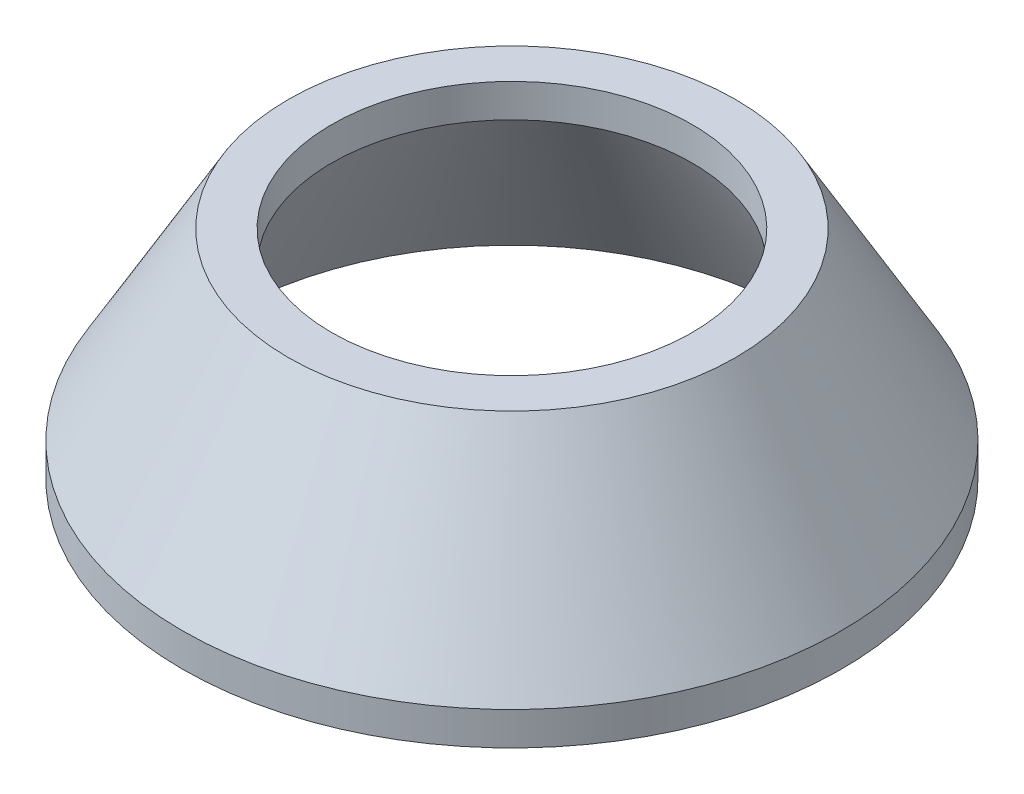
ISO-10303-21;
HEADER;
FILE_DESCRIPTION(('STEP AP214'),'2;1');
FILE_NAME('part.step','',(''),(''),'','','');
FILE_SCHEMA(('AUTOMOTIVE_DESIGN { 1 0 10303 214 1 1 1 1 }'));
ENDSEC;
DATA;
#1=APPLICATION_CONTEXT('core data for automotive mechanical design processes');
#2=APPLICATION_PROTOCOL_DEFINITION('international standard','automotive_design',2000,#1);
#3=PRODUCT_CONTEXT('',#1,'mechanical');
#4=PRODUCT('Part','Part','',(#3));
#5=PRODUCT_RELATED_PRODUCT_CATEGORY('part','',(#4));
#6=PRODUCT_DEFINITION_FORMATION('','',#4);
#7=PRODUCT_DEFINITION_CONTEXT('part definition',#1,'design');
#8=PRODUCT_DEFINITION('design','',#6,#7);
#9=PRODUCT_DEFINITION_SHAPE('','',#8);
#10=(LENGTH_UNIT() NAMED_UNIT(*) SI_UNIT(.MILLI.,.METRE.));
#11=(NAMED_UNIT(*) PLANE_ANGLE_UNIT() SI_UNIT($,.RADIAN.));
#12=(NAMED_UNIT(*) SI_UNIT($,.STERADIAN.) SOLID_ANGLE_UNIT());
#13=UNCERTAINTY_MEASURE_WITH_UNIT(LENGTH_MEASURE(1.E-05),#10,'distance_accuracy_value','');
#14=(GEOMETRIC_REPRESENTATION_CONTEXT(3) GLOBAL_UNCERTAINTY_ASSIGNED_CONTEXT((#13)) GLOBAL_UNIT_ASSIGNED_CONTEXT((#10,
#11,#12)) REPRESENTATION_CONTEXT('',''));
#15=CARTESIAN_POINT('',(0.,0.,0.));
#16=DIRECTION('',(0.,0.,1.));
#17=DIRECTION('',(1.,0.,0.));
#18=AXIS2_PLACEMENT_3D('',#15,#16,#17);
#19=CARTESIAN_POINT('',(41.25,40.,0.));
#20=DIRECTION('',(0.,-1.,0.));
#21=DIRECTION('',(0.,0.,-1.));
#22=AXIS2_PLACEMENT_3D('',#19,#20,#21);
#23=PLANE('',#22);
#24=CARTESIAN_POINT('',(0.,40.,0.));
#25=DIRECTION('',(0.,1.,0.));
#26=DIRECTION('',(0.,0.,1.));
#27=AXIS2_PLACEMENT_3D('',#24,#25,#26);
#28=CIRCLE('',#27,33.25);
#29=CARTESIAN_POINT('',(0.,40.,33.25));
#30=VERTEX_POINT('',#29);
#31=EDGE_CURVE('E10',#30,#30,#28,.T.);
#32=ORIENTED_EDGE('',*,*,#31,.F.);
#33=EDGE_LOOP('',(#32));
#34=FACE_BOUND('',#33,.T.);
#35=CARTESIAN_POINT('',(0.,40.,0.));
#36=DIRECTION('',(0.,1.,0.));
#37=DIRECTION('',(0.,0.,1.));
#38=AXIS2_PLACEMENT_3D('',#35,#36,#37);
#39=CIRCLE('',#38,41.25);
#40=CARTESIAN_POINT('',(0.,40.,41.25));
#41=VERTEX_POINT('',#40);
#42=EDGE_CURVE('E57',#41,#41,#39,.T.);
#43=ORIENTED_EDGE('',*,*,#42,.T.);
#44=EDGE_LOOP('',(#43));
#45=FACE_BOUND('',#44,.T.);
#46=ADVANCED_FACE('F35',(#34,#45),#23,.F.);
#47=CARTESIAN_POINT('',(0.,26.3830045130862,0.));
#48=DIRECTION('',(0.,1.,0.));
#49=DIRECTION('',(0.,0.,1.));
#50=AXIS2_PLACEMENT_3D('',#47,#48,#49);
#51=CYLINDRICAL_SURFACE('',#50,33.25);
#52=CARTESIAN_POINT('',(0.,33.856406460551,0.));
#53=DIRECTION('',(0.,1.,0.));
#54=DIRECTION('',(0.,0.,1.));
#55=AXIS2_PLACEMENT_3D('',#52,#53,#54);
#56=CIRCLE('',#55,33.25);
#57=CARTESIAN_POINT('',(0.,33.856406460551,33.25));
#58=VERTEX_POINT('',#57);
#59=EDGE_CURVE('E41',#58,#58,#56,.T.);
#60=ORIENTED_EDGE('',*,*,#59,.F.);
#61=EDGE_LOOP('',(#60));
#62=FACE_BOUND('',#61,.T.);
#63=ORIENTED_EDGE('',*,*,#31,.T.);
#64=EDGE_LOOP('',(#63));
#65=FACE_BOUND('',#64,.T.);
#66=ADVANCED_FACE('F82',(#62,#65),#51,.F.);
#67=CARTESIAN_POINT('',(0.,33.856406460551,0.));
#68=DIRECTION('',(0.,-1.,0.));
#69=DIRECTION('',(0.,0.,-1.));
#70=AXIS2_PLACEMENT_3D('',#67,#68,#69);
#71=CONICAL_SURFACE('',#70,33.25,0.523598775598293);
#72=CARTESIAN_POINT('',(0.,0.,0.));
#73=DIRECTION('',(0.,1.,0.));
#74=DIRECTION('',(0.,0.,1.));
#75=AXIS2_PLACEMENT_3D('',#72,#73,#74);
#76=CIRCLE('',#75,52.7970053837923);
#77=CARTESIAN_POINT('',(0.,0.,52.7970053837923));
#78=VERTEX_POINT('',#77);
#79=EDGE_CURVE('E45',#78,#78,#76,.T.);
#80=ORIENTED_EDGE('',*,*,#79,.F.);
#81=EDGE_LOOP('',(#80));
#82=FACE_BOUND('',#81,.T.);
#83=ORIENTED_EDGE('',*,*,#59,.T.);
#84=EDGE_LOOP('',(#83));
#85=FACE_BOUND('',#84,.T.);
#86=ADVANCED_FACE('F77',(#82,#85),#71,.F.);
#87=CARTESIAN_POINT('',(52.7970053837923,0.,0.));
#88=DIRECTION('',(0.,1.,0.));
#89=DIRECTION('',(0.,0.,1.));
#90=AXIS2_PLACEMENT_3D('',#87,#88,#89);
#91=PLANE('',#90);
#92=CARTESIAN_POINT('',(0.,0.,0.));
#93=DIRECTION('',(0.,1.,0.));
#94=DIRECTION('',(0.,0.,1.));
#95=AXIS2_PLACEMENT_3D('',#92,#93,#94);
#96=CIRCLE('',#95,60.7970053837923);
#97=CARTESIAN_POINT('',(0.,0.,60.7970053837923));
#98=VERTEX_POINT('',#97);
#99=EDGE_CURVE('E49',#98,#98,#96,.T.);
#100=ORIENTED_EDGE('',*,*,#99,.F.);
#101=EDGE_LOOP('',(#100));
#102=FACE_BOUND('',#101,.T.);
#103=ORIENTED_EDGE('',*,*,#79,.T.);
#104=EDGE_LOOP('',(#103));
#105=FACE_BOUND('',#104,.T.);
#106=ADVANCED_FACE('F71',(#102,#105),#91,.F.);
#107=CARTESIAN_POINT('',(0.,26.3830045130862,0.));
#108=DIRECTION('',(0.,1.,0.));
#109=DIRECTION('',(0.,0.,1.));
#110=AXIS2_PLACEMENT_3D('',#107,#108,#109);
#111=CYLINDRICAL_SURFACE('',#110,60.7970053837923);
#112=CARTESIAN_POINT('',(0.,6.14359353944897,0.));
#113=DIRECTION('',(0.,1.,0.));
#114=DIRECTION('',(0.,0.,1.));
#115=AXIS2_PLACEMENT_3D('',#112,#113,#114);
#116=CIRCLE('',#115,60.7970053837923);
#117=CARTESIAN_POINT('',(0.,6.14359353944897,60.7970053837923));
#118=VERTEX_POINT('',#117);
#119=EDGE_CURVE('E54',#118,#118,#116,.T.);
#120=ORIENTED_EDGE('',*,*,#119,.F.);
#121=EDGE_LOOP('',(#120));
#122=FACE_BOUND('',#121,.T.);
#123=ORIENTED_EDGE('',*,*,#99,.T.);
#124=EDGE_LOOP('',(#123));
#125=FACE_BOUND('',#124,.T.);
#126=ADVANCED_FACE('F65',(#122,#125),#111,.T.);
#127=CARTESIAN_POINT('',(0.,6.14359353944897,0.));
#128=DIRECTION('',(0.,-1.,0.));
#129=DIRECTION('',(0.,0.,-1.));
#130=AXIS2_PLACEMENT_3D('',#127,#128,#129);
#131=CONICAL_SURFACE('',#130,60.7970053837923,0.523598775598293);
#132=ORIENTED_EDGE('',*,*,#42,.F.);
#133=EDGE_LOOP('',(#132));
#134=FACE_BOUND('',#133,.T.);
#135=ORIENTED_EDGE('',*,*,#119,.T.);
#136=EDGE_LOOP('',(#135));
#137=FACE_BOUND('',#136,.T.);
#138=ADVANCED_FACE('F62',(#134,#137),#131,.T.);
#139=CLOSED_SHELL('',(#46,#66,#86,#106,#126,#138));
#140=MANIFOLD_SOLID_BREP('B2',#139);
#141=ADVANCED_BREP_SHAPE_REPRESENTATION('',(#18,#140),#14);
#142=SHAPE_DEFINITION_REPRESENTATION(#9,#141);
ENDSEC;
END-ISO-10303-21;
